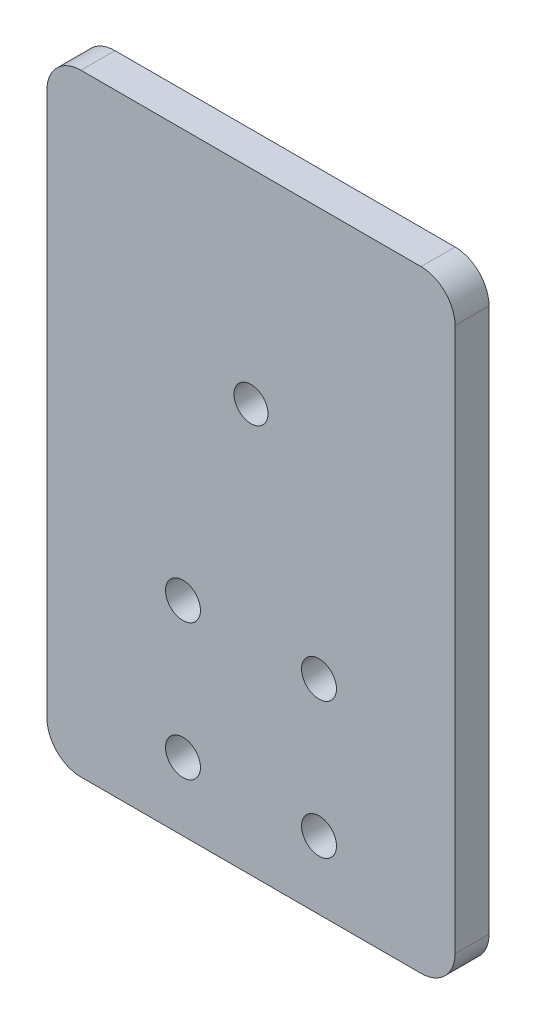
ISO-10303-21;
HEADER;
FILE_DESCRIPTION(('STEP AP214'),'2;1');
FILE_NAME('part.step','',(''),(''),'','','');
FILE_SCHEMA(('AUTOMOTIVE_DESIGN { 1 0 10303 214 1 1 1 1 }'));
ENDSEC;
DATA;
#1=APPLICATION_CONTEXT('core data for automotive mechanical design processes');
#2=APPLICATION_PROTOCOL_DEFINITION('international standard','automotive_design',2000,#1);
#3=PRODUCT_CONTEXT('',#1,'mechanical');
#4=PRODUCT('Part','Part','',(#3));
#5=PRODUCT_RELATED_PRODUCT_CATEGORY('part','',(#4));
#6=PRODUCT_DEFINITION_FORMATION('','',#4);
#7=PRODUCT_DEFINITION_CONTEXT('part definition',#1,'design');
#8=PRODUCT_DEFINITION('design','',#6,#7);
#9=PRODUCT_DEFINITION_SHAPE('','',#8);
#10=(LENGTH_UNIT() NAMED_UNIT(*) SI_UNIT(.MILLI.,.METRE.));
#11=(NAMED_UNIT(*) PLANE_ANGLE_UNIT() SI_UNIT($,.RADIAN.));
#12=(NAMED_UNIT(*) SI_UNIT($,.STERADIAN.) SOLID_ANGLE_UNIT());
#13=UNCERTAINTY_MEASURE_WITH_UNIT(LENGTH_MEASURE(1.E-05),#10,'distance_accuracy_value','');
#14=(GEOMETRIC_REPRESENTATION_CONTEXT(3) GLOBAL_UNCERTAINTY_ASSIGNED_CONTEXT((#13)) GLOBAL_UNIT_ASSIGNED_CONTEXT((#10,
#11,#12)) REPRESENTATION_CONTEXT('',''));
#15=CARTESIAN_POINT('',(0.,0.,0.));
#16=DIRECTION('',(0.,0.,1.));
#17=DIRECTION('',(1.,0.,0.));
#18=AXIS2_PLACEMENT_3D('',#15,#16,#17);
#19=CARTESIAN_POINT('',(0.,114.3,6.35));
#20=DIRECTION('',(0.,0.,-1.));
#21=DIRECTION('',(-1.,0.,0.));
#22=AXIS2_PLACEMENT_3D('',#19,#20,#21);
#23=PLANE('',#22);
#24=CARTESIAN_POINT('',(25.3999999999999,38.1,6.35));
#25=DIRECTION('',(0.,0.,1.));
#26=DIRECTION('',(1.,0.,0.));
#27=AXIS2_PLACEMENT_3D('',#24,#25,#26);
#28=CIRCLE('',#27,3.2639);
#29=CARTESIAN_POINT('',(28.6638999999999,38.1,6.35));
#30=VERTEX_POINT('',#29);
#31=EDGE_CURVE('E334',#30,#30,#28,.T.);
#32=ORIENTED_EDGE('',*,*,#31,.F.);
#33=EDGE_LOOP('',(#32));
#34=FACE_BOUND('',#33,.T.);
#35=CARTESIAN_POINT('',(38.1,76.2,6.35));
#36=DIRECTION('',(0.,0.,1.));
#37=DIRECTION('',(1.,0.,0.));
#38=AXIS2_PLACEMENT_3D('',#35,#36,#37);
#39=CIRCLE('',#38,3.175);
#40=CARTESIAN_POINT('',(41.275,76.2,6.35));
#41=VERTEX_POINT('',#40);
#42=EDGE_CURVE('E319',#41,#41,#39,.T.);
#43=ORIENTED_EDGE('',*,*,#42,.F.);
#44=EDGE_LOOP('',(#43));
#45=FACE_BOUND('',#44,.T.);
#46=DIRECTION('',(1.,0.,0.));
#47=VECTOR('',#46,1.);
#48=CARTESIAN_POINT('',(0.,0.,6.35));
#49=LINE('',#48,#47);
#50=CARTESIAN_POINT('',(6.35,0.,6.35));
#51=VERTEX_POINT('',#50);
#52=CARTESIAN_POINT('',(69.85,0.,6.35));
#53=VERTEX_POINT('',#52);
#54=EDGE_CURVE('E133',#51,#53,#49,.T.);
#55=ORIENTED_EDGE('',*,*,#54,.T.);
#56=CARTESIAN_POINT('',(69.85,6.35,6.35));
#57=DIRECTION('',(0.,0.,-1.));
#58=DIRECTION('',(-1.,0.,0.));
#59=AXIS2_PLACEMENT_3D('',#56,#57,#58);
#60=CIRCLE('',#59,6.35);
#61=CARTESIAN_POINT('',(76.2,6.35,6.35));
#62=VERTEX_POINT('',#61);
#63=EDGE_CURVE('E152',#53,#62,#60,.F.);
#64=ORIENTED_EDGE('',*,*,#63,.T.);
#65=DIRECTION('',(0.,1.,0.));
#66=VECTOR('',#65,1.);
#67=CARTESIAN_POINT('',(76.2,0.,6.35));
#68=LINE('',#67,#66);
#69=CARTESIAN_POINT('',(76.2,107.95,6.35));
#70=VERTEX_POINT('',#69);
#71=EDGE_CURVE('E115',#62,#70,#68,.T.);
#72=ORIENTED_EDGE('',*,*,#71,.T.);
#73=CARTESIAN_POINT('',(69.85,107.95,6.35));
#74=DIRECTION('',(0.,0.,-1.));
#75=DIRECTION('',(-1.,0.,0.));
#76=AXIS2_PLACEMENT_3D('',#73,#74,#75);
#77=CIRCLE('',#76,6.35);
#78=CARTESIAN_POINT('',(69.85,114.3,6.35));
#79=VERTEX_POINT('',#78);
#80=EDGE_CURVE('E51',#70,#79,#77,.F.);
#81=ORIENTED_EDGE('',*,*,#80,.T.);
#82=DIRECTION('',(-1.,0.,0.));
#83=VECTOR('',#82,1.);
#84=CARTESIAN_POINT('',(0.,114.3,6.35));
#85=LINE('',#84,#83);
#86=CARTESIAN_POINT('',(6.35,114.3,6.35));
#87=VERTEX_POINT('',#86);
#88=EDGE_CURVE('E137',#79,#87,#85,.T.);
#89=ORIENTED_EDGE('',*,*,#88,.T.);
#90=CARTESIAN_POINT('',(6.35,107.95,6.35));
#91=DIRECTION('',(0.,0.,-1.));
#92=DIRECTION('',(-1.,0.,0.));
#93=AXIS2_PLACEMENT_3D('',#90,#91,#92);
#94=CIRCLE('',#93,6.35);
#95=CARTESIAN_POINT('',(0.,107.95,6.35));
#96=VERTEX_POINT('',#95);
#97=EDGE_CURVE('E148',#87,#96,#94,.F.);
#98=ORIENTED_EDGE('',*,*,#97,.T.);
#99=DIRECTION('',(0.,-1.,0.));
#100=VECTOR('',#99,1.);
#101=CARTESIAN_POINT('',(0.,0.,6.35));
#102=LINE('',#101,#100);
#103=CARTESIAN_POINT('',(0.,6.35,6.35));
#104=VERTEX_POINT('',#103);
#105=EDGE_CURVE('E125',#96,#104,#102,.T.);
#106=ORIENTED_EDGE('',*,*,#105,.T.);
#107=CARTESIAN_POINT('',(6.35,6.35,6.35));
#108=DIRECTION('',(0.,0.,-1.));
#109=DIRECTION('',(-1.,0.,0.));
#110=AXIS2_PLACEMENT_3D('',#107,#108,#109);
#111=CIRCLE('',#110,6.35);
#112=EDGE_CURVE('E150',#104,#51,#111,.F.);
#113=ORIENTED_EDGE('',*,*,#112,.T.);
#114=EDGE_LOOP('',(#55,#64,#72,#81,#89,#98,#106,#113));
#115=FACE_BOUND('',#114,.T.);
#116=CARTESIAN_POINT('',(25.4,12.7,6.35));
#117=DIRECTION('',(0.,0.,1.));
#118=DIRECTION('',(1.,0.,0.));
#119=AXIS2_PLACEMENT_3D('',#116,#117,#118);
#120=CIRCLE('',#119,3.2639);
#121=CARTESIAN_POINT('',(28.6639,12.7,6.35));
#122=VERTEX_POINT('',#121);
#123=EDGE_CURVE('E315',#122,#122,#120,.T.);
#124=ORIENTED_EDGE('',*,*,#123,.F.);
#125=EDGE_LOOP('',(#124));
#126=FACE_BOUND('',#125,.T.);
#127=CARTESIAN_POINT('',(50.8,12.7,6.35));
#128=DIRECTION('',(0.,0.,1.));
#129=DIRECTION('',(1.,0.,0.));
#130=AXIS2_PLACEMENT_3D('',#127,#128,#129);
#131=CIRCLE('',#130,3.26390000000001);
#132=CARTESIAN_POINT('',(54.0639,12.7,6.35));
#133=VERTEX_POINT('',#132);
#134=EDGE_CURVE('E328',#133,#133,#131,.T.);
#135=ORIENTED_EDGE('',*,*,#134,.F.);
#136=EDGE_LOOP('',(#135));
#137=FACE_BOUND('',#136,.T.);
#138=CARTESIAN_POINT('',(50.7999999999999,38.1,6.35));
#139=DIRECTION('',(0.,0.,1.));
#140=DIRECTION('',(1.,0.,0.));
#141=AXIS2_PLACEMENT_3D('',#138,#139,#140);
#142=CIRCLE('',#141,3.26389999999999);
#143=CARTESIAN_POINT('',(54.0638999999999,38.1,6.35));
#144=VERTEX_POINT('',#143);
#145=EDGE_CURVE('E340',#144,#144,#142,.T.);
#146=ORIENTED_EDGE('',*,*,#145,.F.);
#147=EDGE_LOOP('',(#146));
#148=FACE_BOUND('',#147,.T.);
#149=ADVANCED_FACE('F31',(#34,#45,#115,#126,#137,#148),#23,.F.);
#150=CARTESIAN_POINT('',(0.,114.3,0.));
#151=DIRECTION('',(0.,0.,-1.));
#152=DIRECTION('',(-1.,0.,0.));
#153=AXIS2_PLACEMENT_3D('',#150,#151,#152);
#154=PLANE('',#153);
#155=CARTESIAN_POINT('',(25.3999999999999,38.1,0.));
#156=DIRECTION('',(0.,0.,1.));
#157=DIRECTION('',(1.,0.,0.));
#158=AXIS2_PLACEMENT_3D('',#155,#156,#157);
#159=CIRCLE('',#158,3.2639);
#160=CARTESIAN_POINT('',(28.6638999999999,38.1,0.));
#161=VERTEX_POINT('',#160);
#162=EDGE_CURVE('E337',#161,#161,#159,.T.);
#163=ORIENTED_EDGE('',*,*,#162,.T.);
#164=EDGE_LOOP('',(#163));
#165=FACE_BOUND('',#164,.T.);
#166=CARTESIAN_POINT('',(38.1,76.2,0.));
#167=DIRECTION('',(0.,0.,1.));
#168=DIRECTION('',(1.,0.,0.));
#169=AXIS2_PLACEMENT_3D('',#166,#167,#168);
#170=CIRCLE('',#169,3.175);
#171=CARTESIAN_POINT('',(41.275,76.2,0.));
#172=VERTEX_POINT('',#171);
#173=EDGE_CURVE('E323',#172,#172,#170,.T.);
#174=ORIENTED_EDGE('',*,*,#173,.T.);
#175=EDGE_LOOP('',(#174));
#176=FACE_BOUND('',#175,.T.);
#177=DIRECTION('',(0.,1.,0.));
#178=VECTOR('',#177,1.);
#179=CARTESIAN_POINT('',(76.2,0.,0.));
#180=LINE('',#179,#178);
#181=CARTESIAN_POINT('',(76.2,6.35,0.));
#182=VERTEX_POINT('',#181);
#183=CARTESIAN_POINT('',(76.2,107.95,0.));
#184=VERTEX_POINT('',#183);
#185=EDGE_CURVE('E113',#182,#184,#180,.T.);
#186=ORIENTED_EDGE('',*,*,#185,.F.);
#187=CARTESIAN_POINT('',(69.85,6.35,0.));
#188=DIRECTION('',(0.,0.,-1.));
#189=DIRECTION('',(-1.,0.,0.));
#190=AXIS2_PLACEMENT_3D('',#187,#188,#189);
#191=CIRCLE('',#190,6.35);
#192=CARTESIAN_POINT('',(69.85,0.,0.));
#193=VERTEX_POINT('',#192);
#194=EDGE_CURVE('E96',#182,#193,#191,.T.);
#195=ORIENTED_EDGE('',*,*,#194,.T.);
#196=DIRECTION('',(1.,0.,0.));
#197=VECTOR('',#196,1.);
#198=CARTESIAN_POINT('',(0.,0.,0.));
#199=LINE('',#198,#197);
#200=CARTESIAN_POINT('',(6.35,0.,0.));
#201=VERTEX_POINT('',#200);
#202=EDGE_CURVE('E123',#201,#193,#199,.T.);
#203=ORIENTED_EDGE('',*,*,#202,.F.);
#204=CARTESIAN_POINT('',(6.35,6.35,0.));
#205=DIRECTION('',(0.,0.,-1.));
#206=DIRECTION('',(-1.,0.,0.));
#207=AXIS2_PLACEMENT_3D('',#204,#205,#206);
#208=CIRCLE('',#207,6.35);
#209=CARTESIAN_POINT('',(0.,6.35,0.));
#210=VERTEX_POINT('',#209);
#211=EDGE_CURVE('E107',#201,#210,#208,.T.);
#212=ORIENTED_EDGE('',*,*,#211,.T.);
#213=DIRECTION('',(0.,-1.,0.));
#214=VECTOR('',#213,1.);
#215=CARTESIAN_POINT('',(0.,0.,0.));
#216=LINE('',#215,#214);
#217=CARTESIAN_POINT('',(0.,107.95,0.));
#218=VERTEX_POINT('',#217);
#219=EDGE_CURVE('E127',#218,#210,#216,.T.);
#220=ORIENTED_EDGE('',*,*,#219,.F.);
#221=CARTESIAN_POINT('',(6.35,107.95,0.));
#222=DIRECTION('',(0.,0.,-1.));
#223=DIRECTION('',(-1.,0.,0.));
#224=AXIS2_PLACEMENT_3D('',#221,#222,#223);
#225=CIRCLE('',#224,6.35);
#226=CARTESIAN_POINT('',(6.35,114.3,0.));
#227=VERTEX_POINT('',#226);
#228=EDGE_CURVE('E141',#218,#227,#225,.T.);
#229=ORIENTED_EDGE('',*,*,#228,.T.);
#230=DIRECTION('',(-1.,0.,0.));
#231=VECTOR('',#230,1.);
#232=CARTESIAN_POINT('',(0.,114.3,0.));
#233=LINE('',#232,#231);
#234=CARTESIAN_POINT('',(69.85,114.3,0.));
#235=VERTEX_POINT('',#234);
#236=EDGE_CURVE('E122',#235,#227,#233,.T.);
#237=ORIENTED_EDGE('',*,*,#236,.F.);
#238=CARTESIAN_POINT('',(69.85,107.95,0.));
#239=DIRECTION('',(0.,0.,-1.));
#240=DIRECTION('',(-1.,0.,0.));
#241=AXIS2_PLACEMENT_3D('',#238,#239,#240);
#242=CIRCLE('',#241,6.35);
#243=EDGE_CURVE('E116',#235,#184,#242,.T.);
#244=ORIENTED_EDGE('',*,*,#243,.T.);
#245=EDGE_LOOP('',(#186,#195,#203,#212,#220,#229,#237,#244));
#246=FACE_BOUND('',#245,.T.);
#247=CARTESIAN_POINT('',(25.4,12.7,0.));
#248=DIRECTION('',(0.,0.,1.));
#249=DIRECTION('',(1.,0.,0.));
#250=AXIS2_PLACEMENT_3D('',#247,#248,#249);
#251=CIRCLE('',#250,3.2639);
#252=CARTESIAN_POINT('',(28.6639,12.7,0.));
#253=VERTEX_POINT('',#252);
#254=EDGE_CURVE('E318',#253,#253,#251,.T.);
#255=ORIENTED_EDGE('',*,*,#254,.T.);
#256=EDGE_LOOP('',(#255));
#257=FACE_BOUND('',#256,.T.);
#258=CARTESIAN_POINT('',(50.8,12.7,0.));
#259=DIRECTION('',(0.,0.,1.));
#260=DIRECTION('',(1.,0.,0.));
#261=AXIS2_PLACEMENT_3D('',#258,#259,#260);
#262=CIRCLE('',#261,3.26390000000001);
#263=CARTESIAN_POINT('',(54.0639,12.7,0.));
#264=VERTEX_POINT('',#263);
#265=EDGE_CURVE('E331',#264,#264,#262,.T.);
#266=ORIENTED_EDGE('',*,*,#265,.T.);
#267=EDGE_LOOP('',(#266));
#268=FACE_BOUND('',#267,.T.);
#269=CARTESIAN_POINT('',(50.7999999999999,38.1,0.));
#270=DIRECTION('',(0.,0.,1.));
#271=DIRECTION('',(1.,0.,0.));
#272=AXIS2_PLACEMENT_3D('',#269,#270,#271);
#273=CIRCLE('',#272,3.26389999999999);
#274=CARTESIAN_POINT('',(54.0638999999999,38.1,0.));
#275=VERTEX_POINT('',#274);
#276=EDGE_CURVE('E343',#275,#275,#273,.T.);
#277=ORIENTED_EDGE('',*,*,#276,.T.);
#278=EDGE_LOOP('',(#277));
#279=FACE_BOUND('',#278,.T.);
#280=ADVANCED_FACE('F119',(#165,#176,#246,#257,#268,#279),#154,.T.);
#281=CARTESIAN_POINT('',(0.,0.,6.35));
#282=DIRECTION('',(1.,0.,0.));
#283=DIRECTION('',(0.,0.,-1.));
#284=AXIS2_PLACEMENT_3D('',#281,#282,#283);
#285=PLANE('',#284);
#286=ORIENTED_EDGE('',*,*,#219,.T.);
#287=DIRECTION('',(0.,0.,-1.));
#288=VECTOR('',#287,1.);
#289=CARTESIAN_POINT('',(0.,6.35,6.35));
#290=LINE('',#289,#288);
#291=EDGE_CURVE('E157',#210,#104,#290,.F.);
#292=ORIENTED_EDGE('',*,*,#291,.T.);
#293=ORIENTED_EDGE('',*,*,#105,.F.);
#294=DIRECTION('',(0.,0.,-1.));
#295=VECTOR('',#294,1.);
#296=CARTESIAN_POINT('',(0.,107.95,6.35));
#297=LINE('',#296,#295);
#298=EDGE_CURVE('E154',#96,#218,#297,.T.);
#299=ORIENTED_EDGE('',*,*,#298,.T.);
#300=EDGE_LOOP('',(#286,#292,#293,#299));
#301=FACE_BOUND('',#300,.T.);
#302=ADVANCED_FACE('F33',(#301),#285,.F.);
#303=CARTESIAN_POINT('',(0.,0.,6.35));
#304=DIRECTION('',(0.,1.,0.));
#305=DIRECTION('',(0.,0.,1.));
#306=AXIS2_PLACEMENT_3D('',#303,#304,#305);
#307=PLANE('',#306);
#308=ORIENTED_EDGE('',*,*,#202,.T.);
#309=DIRECTION('',(0.,0.,-1.));
#310=VECTOR('',#309,1.);
#311=CARTESIAN_POINT('',(69.85,0.,6.35));
#312=LINE('',#311,#310);
#313=EDGE_CURVE('E101',#193,#53,#312,.F.);
#314=ORIENTED_EDGE('',*,*,#313,.T.);
#315=ORIENTED_EDGE('',*,*,#54,.F.);
#316=DIRECTION('',(0.,0.,-1.));
#317=VECTOR('',#316,1.);
#318=CARTESIAN_POINT('',(6.35,0.,6.35));
#319=LINE('',#318,#317);
#320=EDGE_CURVE('E106',#51,#201,#319,.T.);
#321=ORIENTED_EDGE('',*,*,#320,.T.);
#322=EDGE_LOOP('',(#308,#314,#315,#321));
#323=FACE_BOUND('',#322,.T.);
#324=ADVANCED_FACE('F178',(#323),#307,.F.);
#325=CARTESIAN_POINT('',(76.2,0.,6.35));
#326=DIRECTION('',(-1.,0.,0.));
#327=DIRECTION('',(0.,0.,1.));
#328=AXIS2_PLACEMENT_3D('',#325,#326,#327);
#329=PLANE('',#328);
#330=ORIENTED_EDGE('',*,*,#71,.F.);
#331=DIRECTION('',(0.,0.,-1.));
#332=VECTOR('',#331,1.);
#333=CARTESIAN_POINT('',(76.2,6.35,6.35));
#334=LINE('',#333,#332);
#335=EDGE_CURVE('E100',#62,#182,#334,.T.);
#336=ORIENTED_EDGE('',*,*,#335,.T.);
#337=ORIENTED_EDGE('',*,*,#185,.T.);
#338=DIRECTION('',(0.,0.,-1.));
#339=VECTOR('',#338,1.);
#340=CARTESIAN_POINT('',(76.2,107.95,6.35));
#341=LINE('',#340,#339);
#342=EDGE_CURVE('E117',#184,#70,#341,.F.);
#343=ORIENTED_EDGE('',*,*,#342,.T.);
#344=EDGE_LOOP('',(#330,#336,#337,#343));
#345=FACE_BOUND('',#344,.T.);
#346=ADVANCED_FACE('F112',(#345),#329,.F.);
#347=CARTESIAN_POINT('',(0.,114.3,6.35));
#348=DIRECTION('',(0.,-1.,0.));
#349=DIRECTION('',(0.,0.,-1.));
#350=AXIS2_PLACEMENT_3D('',#347,#348,#349);
#351=PLANE('',#350);
#352=ORIENTED_EDGE('',*,*,#236,.T.);
#353=DIRECTION('',(0.,0.,-1.));
#354=VECTOR('',#353,1.);
#355=CARTESIAN_POINT('',(6.35,114.3,6.35));
#356=LINE('',#355,#354);
#357=EDGE_CURVE('E11',#227,#87,#356,.F.);
#358=ORIENTED_EDGE('',*,*,#357,.T.);
#359=ORIENTED_EDGE('',*,*,#88,.F.);
#360=DIRECTION('',(0.,0.,-1.));
#361=VECTOR('',#360,1.);
#362=CARTESIAN_POINT('',(69.85,114.3,6.35));
#363=LINE('',#362,#361);
#364=EDGE_CURVE('E39',#79,#235,#363,.T.);
#365=ORIENTED_EDGE('',*,*,#364,.T.);
#366=EDGE_LOOP('',(#352,#358,#359,#365));
#367=FACE_BOUND('',#366,.T.);
#368=ADVANCED_FACE('F160',(#367),#351,.F.);
#369=CARTESIAN_POINT('',(25.4,12.7,6.35));
#370=DIRECTION('',(0.,0.,-1.));
#371=DIRECTION('',(-1.,0.,0.));
#372=AXIS2_PLACEMENT_3D('',#369,#370,#371);
#373=CYLINDRICAL_SURFACE('',#372,3.2639);
#374=ORIENTED_EDGE('',*,*,#123,.T.);
#375=EDGE_LOOP('',(#374));
#376=FACE_BOUND('',#375,.T.);
#377=ORIENTED_EDGE('',*,*,#254,.F.);
#378=EDGE_LOOP('',(#377));
#379=FACE_BOUND('',#378,.T.);
#380=ADVANCED_FACE('F200',(#376,#379),#373,.F.);
#381=CARTESIAN_POINT('',(38.1,76.2,6.35));
#382=DIRECTION('',(0.,0.,-1.));
#383=DIRECTION('',(-1.,0.,0.));
#384=AXIS2_PLACEMENT_3D('',#381,#382,#383);
#385=CYLINDRICAL_SURFACE('',#384,3.175);
#386=ORIENTED_EDGE('',*,*,#42,.T.);
#387=EDGE_LOOP('',(#386));
#388=FACE_BOUND('',#387,.T.);
#389=ORIENTED_EDGE('',*,*,#173,.F.);
#390=EDGE_LOOP('',(#389));
#391=FACE_BOUND('',#390,.T.);
#392=ADVANCED_FACE('F248',(#388,#391),#385,.F.);
#393=CARTESIAN_POINT('',(50.8,12.7,6.35));
#394=DIRECTION('',(0.,0.,-1.));
#395=DIRECTION('',(-1.,0.,0.));
#396=AXIS2_PLACEMENT_3D('',#393,#394,#395);
#397=CYLINDRICAL_SURFACE('',#396,3.26390000000001);
#398=ORIENTED_EDGE('',*,*,#134,.T.);
#399=EDGE_LOOP('',(#398));
#400=FACE_BOUND('',#399,.T.);
#401=ORIENTED_EDGE('',*,*,#265,.F.);
#402=EDGE_LOOP('',(#401));
#403=FACE_BOUND('',#402,.T.);
#404=ADVANCED_FACE('F238',(#400,#403),#397,.F.);
#405=CARTESIAN_POINT('',(25.3999999999999,38.1,6.35));
#406=DIRECTION('',(0.,0.,-1.));
#407=DIRECTION('',(-1.,0.,0.));
#408=AXIS2_PLACEMENT_3D('',#405,#406,#407);
#409=CYLINDRICAL_SURFACE('',#408,3.2639);
#410=ORIENTED_EDGE('',*,*,#31,.T.);
#411=EDGE_LOOP('',(#410));
#412=FACE_BOUND('',#411,.T.);
#413=ORIENTED_EDGE('',*,*,#162,.F.);
#414=EDGE_LOOP('',(#413));
#415=FACE_BOUND('',#414,.T.);
#416=ADVANCED_FACE('F226',(#412,#415),#409,.F.);
#417=CARTESIAN_POINT('',(50.7999999999999,38.1,6.35));
#418=DIRECTION('',(0.,0.,-1.));
#419=DIRECTION('',(-1.,0.,0.));
#420=AXIS2_PLACEMENT_3D('',#417,#418,#419);
#421=CYLINDRICAL_SURFACE('',#420,3.26389999999999);
#422=ORIENTED_EDGE('',*,*,#145,.T.);
#423=EDGE_LOOP('',(#422));
#424=FACE_BOUND('',#423,.T.);
#425=ORIENTED_EDGE('',*,*,#276,.F.);
#426=EDGE_LOOP('',(#425));
#427=FACE_BOUND('',#426,.T.);
#428=ADVANCED_FACE('F221',(#424,#427),#421,.F.);
#429=CARTESIAN_POINT('',(69.85,6.35,6.35));
#430=DIRECTION('',(0.,0.,-1.));
#431=DIRECTION('',(-1.,0.,0.));
#432=AXIS2_PLACEMENT_3D('',#429,#430,#431);
#433=CYLINDRICAL_SURFACE('',#432,6.35);
#434=ORIENTED_EDGE('',*,*,#63,.F.);
#435=ORIENTED_EDGE('',*,*,#313,.F.);
#436=ORIENTED_EDGE('',*,*,#194,.F.);
#437=ORIENTED_EDGE('',*,*,#335,.F.);
#438=EDGE_LOOP('',(#434,#435,#436,#437));
#439=FACE_BOUND('',#438,.T.);
#440=ADVANCED_FACE('F99',(#439),#433,.T.);
#441=CARTESIAN_POINT('',(6.35,6.35,6.35));
#442=DIRECTION('',(0.,0.,-1.));
#443=DIRECTION('',(-1.,0.,0.));
#444=AXIS2_PLACEMENT_3D('',#441,#442,#443);
#445=CYLINDRICAL_SURFACE('',#444,6.35);
#446=ORIENTED_EDGE('',*,*,#112,.F.);
#447=ORIENTED_EDGE('',*,*,#291,.F.);
#448=ORIENTED_EDGE('',*,*,#211,.F.);
#449=ORIENTED_EDGE('',*,*,#320,.F.);
#450=EDGE_LOOP('',(#446,#447,#448,#449));
#451=FACE_BOUND('',#450,.T.);
#452=ADVANCED_FACE('F176',(#451),#445,.T.);
#453=CARTESIAN_POINT('',(6.35,107.95,6.35));
#454=DIRECTION('',(0.,0.,-1.));
#455=DIRECTION('',(-1.,0.,0.));
#456=AXIS2_PLACEMENT_3D('',#453,#454,#455);
#457=CYLINDRICAL_SURFACE('',#456,6.35);
#458=ORIENTED_EDGE('',*,*,#97,.F.);
#459=ORIENTED_EDGE('',*,*,#357,.F.);
#460=ORIENTED_EDGE('',*,*,#228,.F.);
#461=ORIENTED_EDGE('',*,*,#298,.F.);
#462=EDGE_LOOP('',(#458,#459,#460,#461));
#463=FACE_BOUND('',#462,.T.);
#464=ADVANCED_FACE('F167',(#463),#457,.T.);
#465=CARTESIAN_POINT('',(69.85,107.95,6.35));
#466=DIRECTION('',(0.,0.,-1.));
#467=DIRECTION('',(-1.,0.,0.));
#468=AXIS2_PLACEMENT_3D('',#465,#466,#467);
#469=CYLINDRICAL_SURFACE('',#468,6.35);
#470=ORIENTED_EDGE('',*,*,#80,.F.);
#471=ORIENTED_EDGE('',*,*,#342,.F.);
#472=ORIENTED_EDGE('',*,*,#243,.F.);
#473=ORIENTED_EDGE('',*,*,#364,.F.);
#474=EDGE_LOOP('',(#470,#471,#472,#473));
#475=FACE_BOUND('',#474,.T.);
#476=ADVANCED_FACE('F179',(#475),#469,.T.);
#477=CLOSED_SHELL('',(#149,#280,#302,#324,#346,#368,#380,#392,#404,#416,#428,#440,#452,#464,#476));
#478=MANIFOLD_SOLID_BREP('B2',#477);
#479=ADVANCED_BREP_SHAPE_REPRESENTATION('',(#18,#478),#14);
#480=SHAPE_DEFINITION_REPRESENTATION(#9,#479);
ENDSEC;
END-ISO-10303-21;
